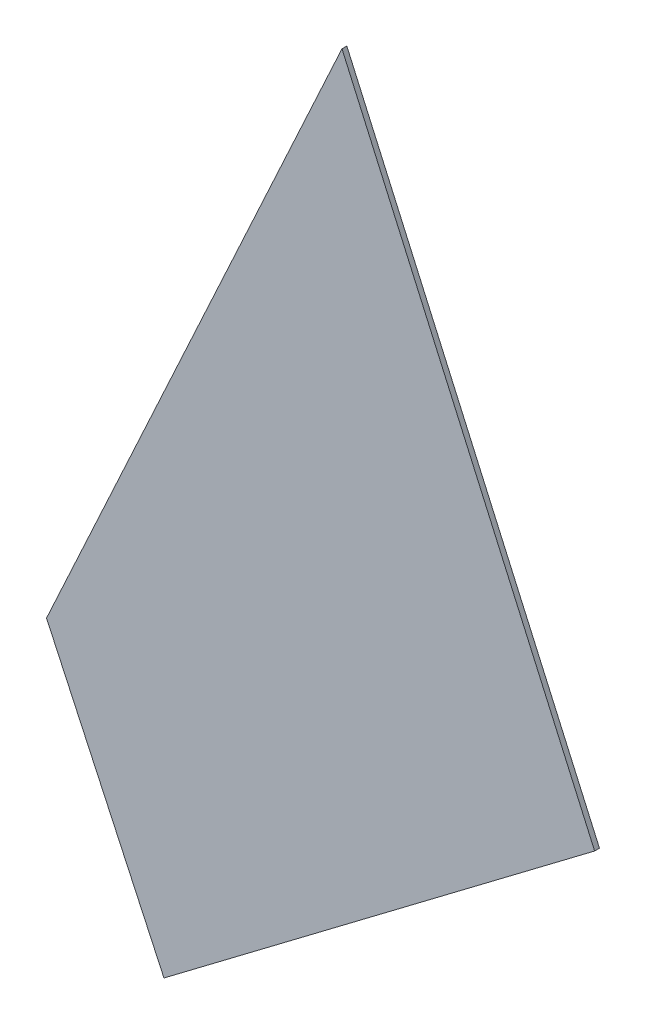
ISO-10303-21;
HEADER;
FILE_DESCRIPTION(('STEP AP214'),'2;1');
FILE_NAME('part.step','',(''),(''),'','','');
FILE_SCHEMA(('AUTOMOTIVE_DESIGN { 1 0 10303 214 1 1 1 1 }'));
ENDSEC;
DATA;
#1=APPLICATION_CONTEXT('core data for automotive mechanical design processes');
#2=APPLICATION_PROTOCOL_DEFINITION('international standard','automotive_design',2000,#1);
#3=PRODUCT_CONTEXT('',#1,'mechanical');
#4=PRODUCT('Part','Part','',(#3));
#5=PRODUCT_RELATED_PRODUCT_CATEGORY('part','',(#4));
#6=PRODUCT_DEFINITION_FORMATION('','',#4);
#7=PRODUCT_DEFINITION_CONTEXT('part definition',#1,'design');
#8=PRODUCT_DEFINITION('design','',#6,#7);
#9=PRODUCT_DEFINITION_SHAPE('','',#8);
#10=(LENGTH_UNIT() NAMED_UNIT(*) SI_UNIT(.MILLI.,.METRE.));
#11=(NAMED_UNIT(*) PLANE_ANGLE_UNIT() SI_UNIT($,.RADIAN.));
#12=(NAMED_UNIT(*) SI_UNIT($,.STERADIAN.) SOLID_ANGLE_UNIT());
#13=UNCERTAINTY_MEASURE_WITH_UNIT(LENGTH_MEASURE(1.E-05),#10,'distance_accuracy_value','');
#14=(GEOMETRIC_REPRESENTATION_CONTEXT(3) GLOBAL_UNCERTAINTY_ASSIGNED_CONTEXT((#13)) GLOBAL_UNIT_ASSIGNED_CONTEXT((#10,
#11,#12)) REPRESENTATION_CONTEXT('',''));
#15=CARTESIAN_POINT('',(0.,0.,0.));
#16=DIRECTION('',(0.,0.,1.));
#17=DIRECTION('',(1.,0.,0.));
#18=AXIS2_PLACEMENT_3D('',#15,#16,#17);
#19=CARTESIAN_POINT('',(51.1612580511734,15.5555341126092,0.1));
#20=DIRECTION('',(-0.602710777432995,0.797959722521203,0.));
#21=DIRECTION('',(-0.797959722521203,-0.602710777432995,0.));
#22=AXIS2_PLACEMENT_3D('',#19,#20,#21);
#23=PLANE('',#22);
#24=DIRECTION('',(0.797959722521203,0.602710777432995,0.));
#25=VECTOR('',#24,1.);
#26=CARTESIAN_POINT('',(51.1612580511734,15.5555341126092,0.));
#27=LINE('',#26,#25);
#28=CARTESIAN_POINT('',(42.2595040261657,8.8319076719437,0.));
#29=VERTEX_POINT('',#28);
#30=CARTESIAN_POINT('',(51.1612580511734,15.5555341126092,0.));
#31=VERTEX_POINT('',#30);
#32=EDGE_CURVE('E96',#29,#31,#27,.T.);
#33=ORIENTED_EDGE('',*,*,#32,.T.);
#34=DIRECTION('',(0.,0.,-1.));
#35=VECTOR('',#34,1.);
#36=CARTESIAN_POINT('',(51.1612580511734,15.5555341126092,0.1));
#37=LINE('',#36,#35);
#38=CARTESIAN_POINT('',(51.1612580511734,15.5555341126092,0.1));
#39=VERTEX_POINT('',#38);
#40=EDGE_CURVE('E11',#39,#31,#37,.T.);
#41=ORIENTED_EDGE('',*,*,#40,.F.);
#42=DIRECTION('',(0.797959722521203,0.602710777432995,0.));
#43=VECTOR('',#42,1.);
#44=CARTESIAN_POINT('',(51.1612580511734,15.5555341126092,0.1));
#45=LINE('',#44,#43);
#46=CARTESIAN_POINT('',(42.2595040261657,8.8319076719437,0.1));
#47=VERTEX_POINT('',#46);
#48=EDGE_CURVE('E84',#47,#39,#45,.T.);
#49=ORIENTED_EDGE('',*,*,#48,.F.);
#50=DIRECTION('',(0.,0.,-1.));
#51=VECTOR('',#50,1.);
#52=CARTESIAN_POINT('',(42.2595040261657,8.8319076719437,0.1));
#53=LINE('',#52,#51);
#54=EDGE_CURVE('E92',#47,#29,#53,.T.);
#55=ORIENTED_EDGE('',*,*,#54,.T.);
#56=EDGE_LOOP('',(#33,#41,#49,#55));
#57=FACE_BOUND('',#56,.T.);
#58=ADVANCED_FACE('F33',(#57),#23,.F.);
#59=CARTESIAN_POINT('',(51.1612580511734,15.5555341126092,0.1));
#60=DIRECTION('',(-0.913794239838535,-0.406177408576492,0.));
#61=DIRECTION('',(0.406177408576492,-0.913794239838535,0.));
#62=AXIS2_PLACEMENT_3D('',#59,#60,#61);
#63=PLANE('',#62);
#64=DIRECTION('',(-0.406177408576492,0.913794239838535,0.));
#65=VECTOR('',#64,1.);
#66=CARTESIAN_POINT('',(51.1612580511734,15.5555341126092,0.));
#67=LINE('',#66,#65);
#68=CARTESIAN_POINT('',(45.9388819909911,27.3045311304149,0.));
#69=VERTEX_POINT('',#68);
#70=EDGE_CURVE('E88',#31,#69,#67,.T.);
#71=ORIENTED_EDGE('',*,*,#70,.T.);
#72=DIRECTION('',(0.,0.,-1.));
#73=VECTOR('',#72,1.);
#74=CARTESIAN_POINT('',(45.9388819909911,27.3045311304149,0.1));
#75=LINE('',#74,#73);
#76=CARTESIAN_POINT('',(45.9388819909911,27.3045311304149,0.1));
#77=VERTEX_POINT('',#76);
#78=EDGE_CURVE('E41',#77,#69,#75,.T.);
#79=ORIENTED_EDGE('',*,*,#78,.F.);
#80=DIRECTION('',(-0.406177408576492,0.913794239838535,0.));
#81=VECTOR('',#80,1.);
#82=CARTESIAN_POINT('',(51.1612580511734,15.5555341126092,0.1));
#83=LINE('',#82,#81);
#84=EDGE_CURVE('E79',#39,#77,#83,.T.);
#85=ORIENTED_EDGE('',*,*,#84,.F.);
#86=ORIENTED_EDGE('',*,*,#40,.T.);
#87=EDGE_LOOP('',(#71,#79,#85,#86));
#88=FACE_BOUND('',#87,.T.);
#89=ADVANCED_FACE('F87',(#88),#63,.F.);
#90=CARTESIAN_POINT('',(39.8319188868193,14.0605930201914,0.1));
#91=DIRECTION('',(0.908106046900274,-0.418740262672648,0.));
#92=DIRECTION('',(0.418740262672648,0.908106046900274,0.));
#93=AXIS2_PLACEMENT_3D('',#90,#91,#92);
#94=PLANE('',#93);
#95=DIRECTION('',(-0.418740262672648,-0.908106046900274,0.));
#96=VECTOR('',#95,1.);
#97=CARTESIAN_POINT('',(39.8319188868193,14.0605930201914,0.));
#98=LINE('',#97,#96);
#99=CARTESIAN_POINT('',(39.8319188868193,14.0605930201914,0.));
#100=VERTEX_POINT('',#99);
#101=EDGE_CURVE('E66',#69,#100,#98,.T.);
#102=ORIENTED_EDGE('',*,*,#101,.T.);
#103=DIRECTION('',(0.,0.,-1.));
#104=VECTOR('',#103,1.);
#105=CARTESIAN_POINT('',(39.8319188868193,14.0605930201914,0.1));
#106=LINE('',#105,#104);
#107=CARTESIAN_POINT('',(39.8319188868193,14.0605930201914,0.1));
#108=VERTEX_POINT('',#107);
#109=EDGE_CURVE('E89',#108,#100,#106,.T.);
#110=ORIENTED_EDGE('',*,*,#109,.F.);
#111=DIRECTION('',(-0.418740262672648,-0.908106046900274,0.));
#112=VECTOR('',#111,1.);
#113=CARTESIAN_POINT('',(39.8319188868193,14.0605930201914,0.1));
#114=LINE('',#113,#112);
#115=EDGE_CURVE('E82',#77,#108,#114,.T.);
#116=ORIENTED_EDGE('',*,*,#115,.F.);
#117=ORIENTED_EDGE('',*,*,#78,.T.);
#118=EDGE_LOOP('',(#102,#110,#116,#117));
#119=FACE_BOUND('',#118,.T.);
#120=ADVANCED_FACE('F90',(#119),#94,.F.);
#121=CARTESIAN_POINT('',(42.2595040261657,8.8319076719437,0.1));
#122=DIRECTION('',(0.907010211533053,0.421108627523547,0.));
#123=DIRECTION('',(-0.421108627523547,0.907010211533053,0.));
#124=AXIS2_PLACEMENT_3D('',#121,#122,#123);
#125=PLANE('',#124);
#126=DIRECTION('',(0.421108627523547,-0.907010211533053,0.));
#127=VECTOR('',#126,1.);
#128=CARTESIAN_POINT('',(42.2595040261657,8.8319076719437,0.));
#129=LINE('',#128,#127);
#130=EDGE_CURVE('E72',#100,#29,#129,.T.);
#131=ORIENTED_EDGE('',*,*,#130,.T.);
#132=ORIENTED_EDGE('',*,*,#54,.F.);
#133=DIRECTION('',(0.421108627523547,-0.907010211533053,0.));
#134=VECTOR('',#133,1.);
#135=CARTESIAN_POINT('',(42.2595040261657,8.8319076719437,0.1));
#136=LINE('',#135,#134);
#137=EDGE_CURVE('E49',#108,#47,#136,.T.);
#138=ORIENTED_EDGE('',*,*,#137,.F.);
#139=ORIENTED_EDGE('',*,*,#109,.T.);
#140=EDGE_LOOP('',(#131,#132,#138,#139));
#141=FACE_BOUND('',#140,.T.);
#142=ADVANCED_FACE('F103',(#141),#125,.F.);
#143=CARTESIAN_POINT('',(0.,0.,0.1));
#144=DIRECTION('',(0.,0.,-1.));
#145=DIRECTION('',(-1.,0.,0.));
#146=AXIS2_PLACEMENT_3D('',#143,#144,#145);
#147=PLANE('',#146);
#148=ORIENTED_EDGE('',*,*,#48,.T.);
#149=ORIENTED_EDGE('',*,*,#84,.T.);
#150=ORIENTED_EDGE('',*,*,#115,.T.);
#151=ORIENTED_EDGE('',*,*,#137,.T.);
#152=EDGE_LOOP('',(#148,#149,#150,#151));
#153=FACE_BOUND('',#152,.T.);
#154=ADVANCED_FACE('F80',(#153),#147,.F.);
#155=CARTESIAN_POINT('',(0.,0.,0.));
#156=DIRECTION('',(0.,0.,-1.));
#157=DIRECTION('',(-1.,0.,0.));
#158=AXIS2_PLACEMENT_3D('',#155,#156,#157);
#159=PLANE('',#158);
#160=ORIENTED_EDGE('',*,*,#32,.F.);
#161=ORIENTED_EDGE('',*,*,#130,.F.);
#162=ORIENTED_EDGE('',*,*,#101,.F.);
#163=ORIENTED_EDGE('',*,*,#70,.F.);
#164=EDGE_LOOP('',(#160,#161,#162,#163));
#165=FACE_BOUND('',#164,.T.);
#166=ADVANCED_FACE('F106',(#165),#159,.T.);
#167=CLOSED_SHELL('',(#58,#89,#120,#142,#154,#166));
#168=MANIFOLD_SOLID_BREP('B2',#167);
#169=ADVANCED_BREP_SHAPE_REPRESENTATION('',(#18,#168),#14);
#170=SHAPE_DEFINITION_REPRESENTATION(#9,#169);
ENDSEC;
END-ISO-10303-21;
